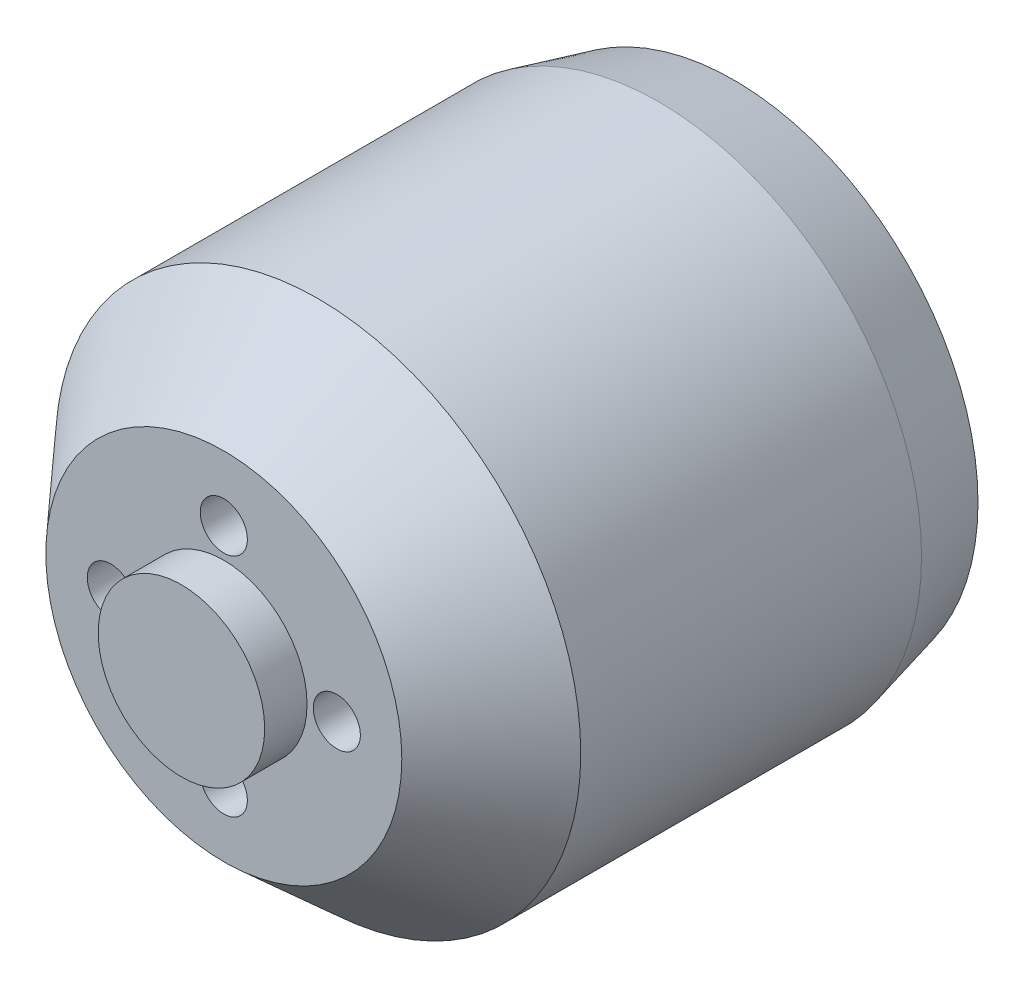
ISO-10303-21;
HEADER;
FILE_DESCRIPTION(('STEP AP214'),'2;1');
FILE_NAME('part.step','',(''),(''),'','','');
FILE_SCHEMA(('AUTOMOTIVE_DESIGN { 1 0 10303 214 1 1 1 1 }'));
ENDSEC;
DATA;
#1=APPLICATION_CONTEXT('core data for automotive mechanical design processes');
#2=APPLICATION_PROTOCOL_DEFINITION('international standard','automotive_design',2000,#1);
#3=PRODUCT_CONTEXT('',#1,'mechanical');
#4=PRODUCT('Part','Part','',(#3));
#5=PRODUCT_RELATED_PRODUCT_CATEGORY('part','',(#4));
#6=PRODUCT_DEFINITION_FORMATION('','',#4);
#7=PRODUCT_DEFINITION_CONTEXT('part definition',#1,'design');
#8=PRODUCT_DEFINITION('design','',#6,#7);
#9=PRODUCT_DEFINITION_SHAPE('','',#8);
#10=(LENGTH_UNIT() NAMED_UNIT(*) SI_UNIT(.MILLI.,.METRE.));
#11=(NAMED_UNIT(*) PLANE_ANGLE_UNIT() SI_UNIT($,.RADIAN.));
#12=(NAMED_UNIT(*) SI_UNIT($,.STERADIAN.) SOLID_ANGLE_UNIT());
#13=UNCERTAINTY_MEASURE_WITH_UNIT(LENGTH_MEASURE(1.E-05),#10,'distance_accuracy_value','');
#14=(GEOMETRIC_REPRESENTATION_CONTEXT(3) GLOBAL_UNCERTAINTY_ASSIGNED_CONTEXT((#13)) GLOBAL_UNIT_ASSIGNED_CONTEXT((#10,
#11,#12)) REPRESENTATION_CONTEXT('',''));
#15=CARTESIAN_POINT('',(0.,0.,0.));
#16=DIRECTION('',(0.,0.,1.));
#17=DIRECTION('',(1.,0.,0.));
#18=AXIS2_PLACEMENT_3D('',#15,#16,#17);
#19=CARTESIAN_POINT('',(0.,0.,0.));
#20=DIRECTION('',(0.,0.,1.));
#21=DIRECTION('',(1.,0.,0.));
#22=AXIS2_PLACEMENT_3D('',#19,#20,#21);
#23=PLANE('',#22);
#24=CARTESIAN_POINT('',(0.,9.5,0.));
#25=DIRECTION('',(0.,0.,-1.));
#26=DIRECTION('',(-1.,0.,0.));
#27=AXIS2_PLACEMENT_3D('',#24,#25,#26);
#28=CIRCLE('',#27,1.75);
#29=CARTESIAN_POINT('',(-1.75,9.5,0.));
#30=VERTEX_POINT('',#29);
#31=EDGE_CURVE('E71',#30,#30,#28,.T.);
#32=ORIENTED_EDGE('',*,*,#31,.F.);
#33=EDGE_LOOP('',(#32));
#34=FACE_BOUND('',#33,.T.);
#35=CARTESIAN_POINT('',(-8.,0.,0.));
#36=DIRECTION('',(0.,0.,-1.));
#37=DIRECTION('',(-1.,0.,0.));
#38=AXIS2_PLACEMENT_3D('',#35,#36,#37);
#39=CIRCLE('',#38,1.75);
#40=CARTESIAN_POINT('',(-9.75,0.,0.));
#41=VERTEX_POINT('',#40);
#42=EDGE_CURVE('E62',#41,#41,#39,.T.);
#43=ORIENTED_EDGE('',*,*,#42,.F.);
#44=EDGE_LOOP('',(#43));
#45=FACE_BOUND('',#44,.T.);
#46=CARTESIAN_POINT('',(0.,0.,0.));
#47=DIRECTION('',(0.,0.,1.));
#48=DIRECTION('',(1.,0.,0.));
#49=AXIS2_PLACEMENT_3D('',#46,#47,#48);
#50=CIRCLE('',#49,12.9499999999999);
#51=CARTESIAN_POINT('',(12.9499999999999,0.,0.));
#52=VERTEX_POINT('',#51);
#53=EDGE_CURVE('E10',#52,#52,#50,.F.);
#54=ORIENTED_EDGE('',*,*,#53,.T.);
#55=EDGE_LOOP('',(#54));
#56=FACE_BOUND('',#55,.T.);
#57=CARTESIAN_POINT('',(0.,-9.5,0.));
#58=DIRECTION('',(0.,0.,-1.));
#59=DIRECTION('',(-1.,0.,0.));
#60=AXIS2_PLACEMENT_3D('',#57,#58,#59);
#61=CIRCLE('',#60,1.75);
#62=CARTESIAN_POINT('',(-1.75,-9.5,0.));
#63=VERTEX_POINT('',#62);
#64=EDGE_CURVE('E78',#63,#63,#61,.F.);
#65=ORIENTED_EDGE('',*,*,#64,.T.);
#66=EDGE_LOOP('',(#65));
#67=FACE_BOUND('',#66,.T.);
#68=CARTESIAN_POINT('',(8.,0.,0.));
#69=DIRECTION('',(0.,0.,-1.));
#70=DIRECTION('',(-1.,0.,0.));
#71=AXIS2_PLACEMENT_3D('',#68,#69,#70);
#72=CIRCLE('',#71,1.75);
#73=CARTESIAN_POINT('',(6.25,0.,0.));
#74=VERTEX_POINT('',#73);
#75=EDGE_CURVE('E65',#74,#74,#72,.F.);
#76=ORIENTED_EDGE('',*,*,#75,.T.);
#77=EDGE_LOOP('',(#76));
#78=FACE_BOUND('',#77,.T.);
#79=ADVANCED_FACE('F35',(#34,#45,#56,#67,#78),#23,.F.);
#80=CARTESIAN_POINT('',(0.,0.,29.34));
#81=DIRECTION('',(0.,0.,-1.));
#82=DIRECTION('',(-1.,0.,0.));
#83=AXIS2_PLACEMENT_3D('',#80,#81,#82);
#84=CYLINDRICAL_SURFACE('',#83,13.95);
#85=CARTESIAN_POINT('',(0.,0.,4.00000000000057));
#86=DIRECTION('',(0.,0.,1.));
#87=DIRECTION('',(1.,0.,0.));
#88=AXIS2_PLACEMENT_3D('',#85,#86,#87);
#89=CIRCLE('',#88,13.95);
#90=CARTESIAN_POINT('',(13.95,0.,4.00000000000057));
#91=VERTEX_POINT('',#90);
#92=EDGE_CURVE('E42',#91,#91,#89,.T.);
#93=ORIENTED_EDGE('',*,*,#92,.T.);
#94=EDGE_LOOP('',(#93));
#95=FACE_BOUND('',#94,.T.);
#96=CARTESIAN_POINT('',(0.,0.,22.09));
#97=DIRECTION('',(0.,0.,1.));
#98=DIRECTION('',(1.,0.,0.));
#99=AXIS2_PLACEMENT_3D('',#96,#97,#98);
#100=CIRCLE('',#99,13.95);
#101=CARTESIAN_POINT('',(13.95,0.,22.09));
#102=VERTEX_POINT('',#101);
#103=EDGE_CURVE('E46',#102,#102,#100,.F.);
#104=ORIENTED_EDGE('',*,*,#103,.T.);
#105=EDGE_LOOP('',(#104));
#106=FACE_BOUND('',#105,.T.);
#107=ADVANCED_FACE('F137',(#95,#106),#84,.T.);
#108=CARTESIAN_POINT('',(0.,0.,27.09));
#109=DIRECTION('',(0.,0.,1.));
#110=DIRECTION('',(1.,0.,0.));
#111=AXIS2_PLACEMENT_3D('',#108,#109,#110);
#112=CYLINDRICAL_SURFACE('',#111,4.42);
#113=CARTESIAN_POINT('',(0.,0.,27.09));
#114=DIRECTION('',(0.,0.,1.));
#115=DIRECTION('',(1.,0.,0.));
#116=AXIS2_PLACEMENT_3D('',#113,#114,#115);
#117=CIRCLE('',#116,4.42);
#118=CARTESIAN_POINT('',(4.42,0.,27.09));
#119=VERTEX_POINT('',#118);
#120=EDGE_CURVE('E55',#119,#119,#117,.T.);
#121=ORIENTED_EDGE('',*,*,#120,.T.);
#122=EDGE_LOOP('',(#121));
#123=FACE_BOUND('',#122,.T.);
#124=CARTESIAN_POINT('',(0.,0.,29.34));
#125=DIRECTION('',(0.,0.,1.));
#126=DIRECTION('',(1.,0.,0.));
#127=AXIS2_PLACEMENT_3D('',#124,#125,#126);
#128=CIRCLE('',#127,4.42);
#129=CARTESIAN_POINT('',(4.42,0.,29.34));
#130=VERTEX_POINT('',#129);
#131=EDGE_CURVE('E56',#130,#130,#128,.T.);
#132=ORIENTED_EDGE('',*,*,#131,.F.);
#133=EDGE_LOOP('',(#132));
#134=FACE_BOUND('',#133,.T.);
#135=ADVANCED_FACE('F123',(#123,#134),#112,.T.);
#136=CARTESIAN_POINT('',(0.,0.,27.09));
#137=DIRECTION('',(0.,0.,1.));
#138=DIRECTION('',(1.,0.,0.));
#139=AXIS2_PLACEMENT_3D('',#136,#137,#138);
#140=PLANE('',#139);
#141=CARTESIAN_POINT('',(6.00000000000017,1.69795468502936E-13,27.09));
#142=DIRECTION('',(0.,0.,1.));
#143=DIRECTION('',(1.,0.,0.));
#144=AXIS2_PLACEMENT_3D('',#141,#142,#143);
#145=CIRCLE('',#144,1.25000000000013);
#146=CARTESIAN_POINT('',(7.2500000000003,1.69795468502936E-13,27.09));
#147=VERTEX_POINT('',#146);
#148=EDGE_CURVE('E104',#147,#147,#145,.T.);
#149=ORIENTED_EDGE('',*,*,#148,.F.);
#150=EDGE_LOOP('',(#149));
#151=FACE_BOUND('',#150,.T.);
#152=CARTESIAN_POINT('',(3.39590937005871E-13,-6.,27.09));
#153=DIRECTION('',(0.,0.,1.));
#154=DIRECTION('',(1.,0.,0.));
#155=AXIS2_PLACEMENT_3D('',#152,#153,#154);
#156=CIRCLE('',#155,1.25000000000036);
#157=CARTESIAN_POINT('',(1.2500000000007,-6.,27.09));
#158=VERTEX_POINT('',#157);
#159=EDGE_CURVE('E98',#158,#158,#156,.T.);
#160=ORIENTED_EDGE('',*,*,#159,.F.);
#161=EDGE_LOOP('',(#160));
#162=FACE_BOUND('',#161,.T.);
#163=CARTESIAN_POINT('',(-5.99999999999983,-1.70530256582424E-13,27.09));
#164=DIRECTION('',(0.,0.,1.));
#165=DIRECTION('',(1.,0.,0.));
#166=AXIS2_PLACEMENT_3D('',#163,#164,#165);
#167=CIRCLE('',#166,1.25000000000027);
#168=CARTESIAN_POINT('',(-4.74999999999956,-1.70530256582424E-13,27.09));
#169=VERTEX_POINT('',#168);
#170=EDGE_CURVE('E92',#169,#169,#167,.T.);
#171=ORIENTED_EDGE('',*,*,#170,.F.);
#172=EDGE_LOOP('',(#171));
#173=FACE_BOUND('',#172,.T.);
#174=CARTESIAN_POINT('',(0.,6.,27.09));
#175=DIRECTION('',(0.,0.,1.));
#176=DIRECTION('',(1.,0.,0.));
#177=AXIS2_PLACEMENT_3D('',#174,#175,#176);
#178=CIRCLE('',#177,1.25);
#179=CARTESIAN_POINT('',(1.25,6.,27.09));
#180=VERTEX_POINT('',#179);
#181=EDGE_CURVE('E86',#180,#180,#178,.T.);
#182=ORIENTED_EDGE('',*,*,#181,.F.);
#183=EDGE_LOOP('',(#182));
#184=FACE_BOUND('',#183,.T.);
#185=CARTESIAN_POINT('',(0.,0.,27.09));
#186=DIRECTION('',(0.,0.,1.));
#187=DIRECTION('',(1.,0.,0.));
#188=AXIS2_PLACEMENT_3D('',#185,#186,#187);
#189=CIRCLE('',#188,9.45000000000001);
#190=CARTESIAN_POINT('',(9.45000000000001,0.,27.09));
#191=VERTEX_POINT('',#190);
#192=EDGE_CURVE('E50',#191,#191,#189,.T.);
#193=ORIENTED_EDGE('',*,*,#192,.T.);
#194=EDGE_LOOP('',(#193));
#195=FACE_BOUND('',#194,.T.);
#196=ORIENTED_EDGE('',*,*,#120,.F.);
#197=EDGE_LOOP('',(#196));
#198=FACE_BOUND('',#197,.T.);
#199=ADVANCED_FACE('F119',(#151,#162,#173,#184,#195,#198),#140,.T.);
#200=CARTESIAN_POINT('',(0.,0.,29.34));
#201=DIRECTION('',(0.,0.,1.));
#202=DIRECTION('',(1.,0.,0.));
#203=AXIS2_PLACEMENT_3D('',#200,#201,#202);
#204=PLANE('',#203);
#205=ORIENTED_EDGE('',*,*,#131,.T.);
#206=EDGE_LOOP('',(#205));
#207=FACE_BOUND('',#206,.T.);
#208=ADVANCED_FACE('F122',(#207),#204,.T.);
#209=CARTESIAN_POINT('',(0.,0.,27.09));
#210=DIRECTION('',(0.,0.,-1.));
#211=DIRECTION('',(-1.,0.,0.));
#212=AXIS2_PLACEMENT_3D('',#209,#210,#211);
#213=CONICAL_SURFACE('',#212,9.45000000000001,0.732815101786506);
#214=ORIENTED_EDGE('',*,*,#103,.F.);
#215=EDGE_LOOP('',(#214));
#216=FACE_BOUND('',#215,.T.);
#217=ORIENTED_EDGE('',*,*,#192,.F.);
#218=EDGE_LOOP('',(#217));
#219=FACE_BOUND('',#218,.T.);
#220=ADVANCED_FACE('F142',(#216,#219),#213,.T.);
#221=CARTESIAN_POINT('',(0.,0.,4.00000000000057));
#222=DIRECTION('',(0.,0.,1.));
#223=DIRECTION('',(1.,0.,0.));
#224=AXIS2_PLACEMENT_3D('',#221,#222,#223);
#225=CONICAL_SURFACE('',#224,13.95,0.244978663126861);
#226=ORIENTED_EDGE('',*,*,#53,.F.);
#227=EDGE_LOOP('',(#226));
#228=FACE_BOUND('',#227,.T.);
#229=ORIENTED_EDGE('',*,*,#92,.F.);
#230=EDGE_LOOP('',(#229));
#231=FACE_BOUND('',#230,.T.);
#232=ADVANCED_FACE('F37',(#228,#231),#225,.T.);
#233=CARTESIAN_POINT('',(-8.,0.,3.));
#234=DIRECTION('',(0.,0.,-1.));
#235=DIRECTION('',(-1.,0.,0.));
#236=AXIS2_PLACEMENT_3D('',#233,#234,#235);
#237=CYLINDRICAL_SURFACE('',#236,1.75);
#238=CARTESIAN_POINT('',(-8.,0.,3.));
#239=DIRECTION('',(0.,0.,-1.));
#240=DIRECTION('',(-1.,0.,0.));
#241=AXIS2_PLACEMENT_3D('',#238,#239,#240);
#242=CIRCLE('',#241,1.75);
#243=CARTESIAN_POINT('',(-9.75,0.,3.));
#244=VERTEX_POINT('',#243);
#245=EDGE_CURVE('E59',#244,#244,#242,.T.);
#246=ORIENTED_EDGE('',*,*,#245,.F.);
#247=EDGE_LOOP('',(#246));
#248=FACE_BOUND('',#247,.T.);
#249=ORIENTED_EDGE('',*,*,#42,.T.);
#250=EDGE_LOOP('',(#249));
#251=FACE_BOUND('',#250,.T.);
#252=ADVANCED_FACE('F196',(#248,#251),#237,.F.);
#253=CARTESIAN_POINT('',(0.,0.,3.));
#254=DIRECTION('',(0.,0.,-1.));
#255=DIRECTION('',(-1.,0.,0.));
#256=AXIS2_PLACEMENT_3D('',#253,#254,#255);
#257=PLANE('',#256);
#258=ORIENTED_EDGE('',*,*,#245,.T.);
#259=EDGE_LOOP('',(#258));
#260=FACE_BOUND('',#259,.T.);
#261=ADVANCED_FACE('F189',(#260),#257,.T.);
#262=CARTESIAN_POINT('',(0.,9.5,3.));
#263=DIRECTION('',(0.,0.,-1.));
#264=DIRECTION('',(-1.,0.,0.));
#265=AXIS2_PLACEMENT_3D('',#262,#263,#264);
#266=CYLINDRICAL_SURFACE('',#265,1.75);
#267=CARTESIAN_POINT('',(0.,9.5,3.));
#268=DIRECTION('',(0.,0.,-1.));
#269=DIRECTION('',(-1.,0.,0.));
#270=AXIS2_PLACEMENT_3D('',#267,#268,#269);
#271=CIRCLE('',#270,1.75);
#272=CARTESIAN_POINT('',(-1.75,9.5,3.));
#273=VERTEX_POINT('',#272);
#274=EDGE_CURVE('E68',#273,#273,#271,.T.);
#275=ORIENTED_EDGE('',*,*,#274,.F.);
#276=EDGE_LOOP('',(#275));
#277=FACE_BOUND('',#276,.T.);
#278=ORIENTED_EDGE('',*,*,#31,.T.);
#279=EDGE_LOOP('',(#278));
#280=FACE_BOUND('',#279,.T.);
#281=ADVANCED_FACE('F186',(#277,#280),#266,.F.);
#282=CARTESIAN_POINT('',(0.,9.5,3.));
#283=DIRECTION('',(0.,0.,-1.));
#284=DIRECTION('',(-1.,0.,0.));
#285=AXIS2_PLACEMENT_3D('',#282,#283,#284);
#286=PLANE('',#285);
#287=ORIENTED_EDGE('',*,*,#274,.T.);
#288=EDGE_LOOP('',(#287));
#289=FACE_BOUND('',#288,.T.);
#290=ADVANCED_FACE('F183',(#289),#286,.T.);
#291=CARTESIAN_POINT('',(0.,-9.5,3.));
#292=DIRECTION('',(0.,0.,-1.));
#293=DIRECTION('',(-1.,0.,0.));
#294=AXIS2_PLACEMENT_3D('',#291,#292,#293);
#295=CYLINDRICAL_SURFACE('',#294,1.75);
#296=CARTESIAN_POINT('',(0.,-9.5,3.));
#297=DIRECTION('',(0.,0.,-1.));
#298=DIRECTION('',(-1.,0.,0.));
#299=AXIS2_PLACEMENT_3D('',#296,#297,#298);
#300=CIRCLE('',#299,1.75);
#301=CARTESIAN_POINT('',(-1.75,-9.5,3.));
#302=VERTEX_POINT('',#301);
#303=EDGE_CURVE('E75',#302,#302,#300,.F.);
#304=ORIENTED_EDGE('',*,*,#303,.T.);
#305=EDGE_LOOP('',(#304));
#306=FACE_BOUND('',#305,.T.);
#307=ORIENTED_EDGE('',*,*,#64,.F.);
#308=EDGE_LOOP('',(#307));
#309=FACE_BOUND('',#308,.T.);
#310=ADVANCED_FACE('F176',(#306,#309),#295,.F.);
#311=CARTESIAN_POINT('',(0.,0.,3.));
#312=DIRECTION('',(0.,0.,-1.));
#313=DIRECTION('',(-1.,0.,0.));
#314=AXIS2_PLACEMENT_3D('',#311,#312,#313);
#315=PLANE('',#314);
#316=ORIENTED_EDGE('',*,*,#303,.F.);
#317=EDGE_LOOP('',(#316));
#318=FACE_BOUND('',#317,.T.);
#319=ADVANCED_FACE('F166',(#318),#315,.T.);
#320=CARTESIAN_POINT('',(8.,0.,3.));
#321=DIRECTION('',(0.,0.,-1.));
#322=DIRECTION('',(-1.,0.,0.));
#323=AXIS2_PLACEMENT_3D('',#320,#321,#322);
#324=CYLINDRICAL_SURFACE('',#323,1.75);
#325=CARTESIAN_POINT('',(8.,0.,3.));
#326=DIRECTION('',(0.,0.,-1.));
#327=DIRECTION('',(-1.,0.,0.));
#328=AXIS2_PLACEMENT_3D('',#325,#326,#327);
#329=CIRCLE('',#328,1.75);
#330=CARTESIAN_POINT('',(6.25,0.,3.));
#331=VERTEX_POINT('',#330);
#332=EDGE_CURVE('E81',#331,#331,#329,.F.);
#333=ORIENTED_EDGE('',*,*,#332,.T.);
#334=EDGE_LOOP('',(#333));
#335=FACE_BOUND('',#334,.T.);
#336=ORIENTED_EDGE('',*,*,#75,.F.);
#337=EDGE_LOOP('',(#336));
#338=FACE_BOUND('',#337,.T.);
#339=ADVANCED_FACE('F163',(#335,#338),#324,.F.);
#340=CARTESIAN_POINT('',(0.,0.,3.));
#341=DIRECTION('',(0.,0.,-1.));
#342=DIRECTION('',(-1.,0.,0.));
#343=AXIS2_PLACEMENT_3D('',#340,#341,#342);
#344=PLANE('',#343);
#345=ORIENTED_EDGE('',*,*,#332,.F.);
#346=EDGE_LOOP('',(#345));
#347=FACE_BOUND('',#346,.T.);
#348=ADVANCED_FACE('F165',(#347),#344,.T.);
#349=CARTESIAN_POINT('',(0.,6.,24.09));
#350=DIRECTION('',(0.,0.,1.));
#351=DIRECTION('',(1.,0.,0.));
#352=AXIS2_PLACEMENT_3D('',#349,#350,#351);
#353=CYLINDRICAL_SURFACE('',#352,1.25);
#354=CARTESIAN_POINT('',(0.,6.,24.09));
#355=DIRECTION('',(0.,0.,1.));
#356=DIRECTION('',(1.,0.,0.));
#357=AXIS2_PLACEMENT_3D('',#354,#355,#356);
#358=CIRCLE('',#357,1.25);
#359=CARTESIAN_POINT('',(1.25,6.,24.09));
#360=VERTEX_POINT('',#359);
#361=EDGE_CURVE('E72',#360,#360,#358,.T.);
#362=ORIENTED_EDGE('',*,*,#361,.F.);
#363=EDGE_LOOP('',(#362));
#364=FACE_BOUND('',#363,.T.);
#365=ORIENTED_EDGE('',*,*,#181,.T.);
#366=EDGE_LOOP('',(#365));
#367=FACE_BOUND('',#366,.T.);
#368=ADVANCED_FACE('F173',(#364,#367),#353,.F.);
#369=CARTESIAN_POINT('',(0.,6.,24.09));
#370=DIRECTION('',(0.,0.,1.));
#371=DIRECTION('',(1.,0.,0.));
#372=AXIS2_PLACEMENT_3D('',#369,#370,#371);
#373=PLANE('',#372);
#374=ORIENTED_EDGE('',*,*,#361,.T.);
#375=EDGE_LOOP('',(#374));
#376=FACE_BOUND('',#375,.T.);
#377=ADVANCED_FACE('F244',(#376),#373,.T.);
#378=CARTESIAN_POINT('',(-5.99999999999983,-1.70530256582424E-13,24.09));
#379=DIRECTION('',(0.,0.,1.));
#380=DIRECTION('',(1.,0.,0.));
#381=AXIS2_PLACEMENT_3D('',#378,#379,#380);
#382=CYLINDRICAL_SURFACE('',#381,1.25000000000027);
#383=CARTESIAN_POINT('',(-5.99999999999983,-1.70530256582424E-13,24.09));
#384=DIRECTION('',(0.,0.,1.));
#385=DIRECTION('',(1.,0.,0.));
#386=AXIS2_PLACEMENT_3D('',#383,#384,#385);
#387=CIRCLE('',#386,1.25000000000027);
#388=CARTESIAN_POINT('',(-4.74999999999956,-1.70530256582424E-13,24.09));
#389=VERTEX_POINT('',#388);
#390=EDGE_CURVE('E95',#389,#389,#387,.T.);
#391=ORIENTED_EDGE('',*,*,#390,.F.);
#392=EDGE_LOOP('',(#391));
#393=FACE_BOUND('',#392,.T.);
#394=ORIENTED_EDGE('',*,*,#170,.T.);
#395=EDGE_LOOP('',(#394));
#396=FACE_BOUND('',#395,.T.);
#397=ADVANCED_FACE('F253',(#393,#396),#382,.F.);
#398=CARTESIAN_POINT('',(-5.99999999999983,-1.70530256582424E-13,24.09));
#399=DIRECTION('',(0.,0.,1.));
#400=DIRECTION('',(1.,0.,0.));
#401=AXIS2_PLACEMENT_3D('',#398,#399,#400);
#402=PLANE('',#401);
#403=ORIENTED_EDGE('',*,*,#390,.T.);
#404=EDGE_LOOP('',(#403));
#405=FACE_BOUND('',#404,.T.);
#406=ADVANCED_FACE('F262',(#405),#402,.T.);
#407=CARTESIAN_POINT('',(3.39590937005871E-13,-6.,24.09));
#408=DIRECTION('',(0.,0.,1.));
#409=DIRECTION('',(1.,0.,0.));
#410=AXIS2_PLACEMENT_3D('',#407,#408,#409);
#411=CYLINDRICAL_SURFACE('',#410,1.25000000000036);
#412=CARTESIAN_POINT('',(3.39590937005871E-13,-6.,24.09));
#413=DIRECTION('',(0.,0.,1.));
#414=DIRECTION('',(1.,0.,0.));
#415=AXIS2_PLACEMENT_3D('',#412,#413,#414);
#416=CIRCLE('',#415,1.25000000000036);
#417=CARTESIAN_POINT('',(1.2500000000007,-6.,24.09));
#418=VERTEX_POINT('',#417);
#419=EDGE_CURVE('E101',#418,#418,#416,.T.);
#420=ORIENTED_EDGE('',*,*,#419,.F.);
#421=EDGE_LOOP('',(#420));
#422=FACE_BOUND('',#421,.T.);
#423=ORIENTED_EDGE('',*,*,#159,.T.);
#424=EDGE_LOOP('',(#423));
#425=FACE_BOUND('',#424,.T.);
#426=ADVANCED_FACE('F272',(#422,#425),#411,.F.);
#427=CARTESIAN_POINT('',(3.39590937005871E-13,-6.,24.09));
#428=DIRECTION('',(0.,0.,1.));
#429=DIRECTION('',(1.,0.,0.));
#430=AXIS2_PLACEMENT_3D('',#427,#428,#429);
#431=PLANE('',#430);
#432=ORIENTED_EDGE('',*,*,#419,.T.);
#433=EDGE_LOOP('',(#432));
#434=FACE_BOUND('',#433,.T.);
#435=ADVANCED_FACE('F115',(#434),#431,.T.);
#436=CARTESIAN_POINT('',(6.00000000000017,1.69795468502936E-13,24.09));
#437=DIRECTION('',(0.,0.,1.));
#438=DIRECTION('',(1.,0.,0.));
#439=AXIS2_PLACEMENT_3D('',#436,#437,#438);
#440=CYLINDRICAL_SURFACE('',#439,1.25000000000013);
#441=CARTESIAN_POINT('',(6.00000000000017,1.69795468502936E-13,24.09));
#442=DIRECTION('',(0.,0.,1.));
#443=DIRECTION('',(1.,0.,0.));
#444=AXIS2_PLACEMENT_3D('',#441,#442,#443);
#445=CIRCLE('',#444,1.25000000000013);
#446=CARTESIAN_POINT('',(7.2500000000003,1.69795468502936E-13,24.09));
#447=VERTEX_POINT('',#446);
#448=EDGE_CURVE('E89',#447,#447,#445,.T.);
#449=ORIENTED_EDGE('',*,*,#448,.F.);
#450=EDGE_LOOP('',(#449));
#451=FACE_BOUND('',#450,.T.);
#452=ORIENTED_EDGE('',*,*,#148,.T.);
#453=EDGE_LOOP('',(#452));
#454=FACE_BOUND('',#453,.T.);
#455=ADVANCED_FACE('F112',(#451,#454),#440,.F.);
#456=CARTESIAN_POINT('',(6.00000000000017,1.69795468502936E-13,24.09));
#457=DIRECTION('',(0.,0.,1.));
#458=DIRECTION('',(1.,0.,0.));
#459=AXIS2_PLACEMENT_3D('',#456,#457,#458);
#460=PLANE('',#459);
#461=ORIENTED_EDGE('',*,*,#448,.T.);
#462=EDGE_LOOP('',(#461));
#463=FACE_BOUND('',#462,.T.);
#464=ADVANCED_FACE('F110',(#463),#460,.T.);
#465=CLOSED_SHELL('',(#79,#107,#135,#199,#208,#220,#232,#252,#261,#281,#290,#310,#319,#339,#348,
#368,#377,#397,#406,#426,#435,#455,#464));
#466=MANIFOLD_SOLID_BREP('B2',#465);
#467=ADVANCED_BREP_SHAPE_REPRESENTATION('',(#18,#466),#14);
#468=SHAPE_DEFINITION_REPRESENTATION(#9,#467);
ENDSEC;
END-ISO-10303-21;
